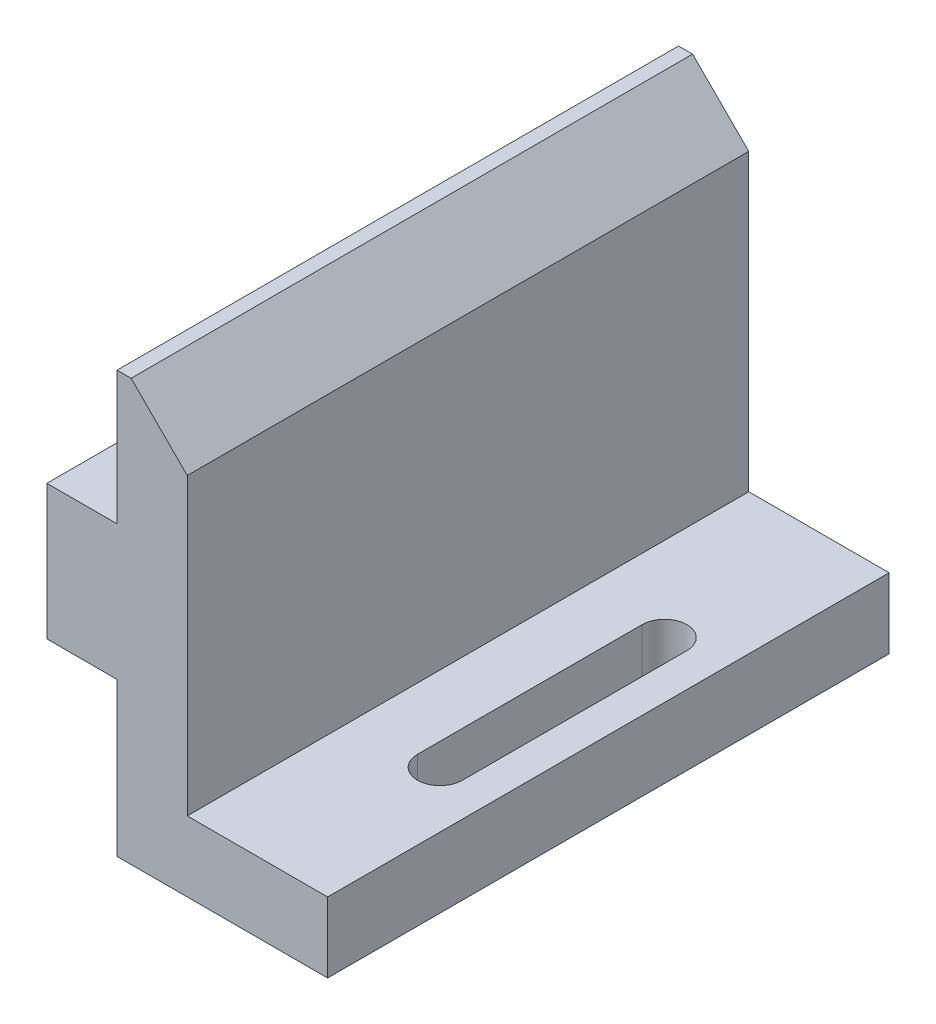
ISO-10303-21;
HEADER;
FILE_DESCRIPTION(('STEP AP214'),'2;1');
FILE_NAME('part.step','',(''),(''),'','','');
FILE_SCHEMA(('AUTOMOTIVE_DESIGN { 1 0 10303 214 1 1 1 1 }'));
ENDSEC;
DATA;
#1=APPLICATION_CONTEXT('core data for automotive mechanical design processes');
#2=APPLICATION_PROTOCOL_DEFINITION('international standard','automotive_design',2000,#1);
#3=PRODUCT_CONTEXT('',#1,'mechanical');
#4=PRODUCT('Part','Part','',(#3));
#5=PRODUCT_RELATED_PRODUCT_CATEGORY('part','',(#4));
#6=PRODUCT_DEFINITION_FORMATION('','',#4);
#7=PRODUCT_DEFINITION_CONTEXT('part definition',#1,'design');
#8=PRODUCT_DEFINITION('design','',#6,#7);
#9=PRODUCT_DEFINITION_SHAPE('','',#8);
#10=(LENGTH_UNIT() NAMED_UNIT(*) SI_UNIT(.MILLI.,.METRE.));
#11=(NAMED_UNIT(*) PLANE_ANGLE_UNIT() SI_UNIT($,.RADIAN.));
#12=(NAMED_UNIT(*) SI_UNIT($,.STERADIAN.) SOLID_ANGLE_UNIT());
#13=UNCERTAINTY_MEASURE_WITH_UNIT(LENGTH_MEASURE(1.E-05),#10,'distance_accuracy_value','');
#14=(GEOMETRIC_REPRESENTATION_CONTEXT(3) GLOBAL_UNCERTAINTY_ASSIGNED_CONTEXT((#13)) GLOBAL_UNIT_ASSIGNED_CONTEXT((#10,
#11,#12)) REPRESENTATION_CONTEXT('',''));
#15=CARTESIAN_POINT('',(0.,0.,0.));
#16=DIRECTION('',(0.,0.,1.));
#17=DIRECTION('',(1.,0.,0.));
#18=AXIS2_PLACEMENT_3D('',#15,#16,#17);
#19=CARTESIAN_POINT('',(0.,19.05,12.7));
#20=DIRECTION('',(1.,0.,0.));
#21=DIRECTION('',(0.,1.,0.));
#22=AXIS2_PLACEMENT_3D('',#19,#20,#21);
#23=PLANE('',#22);
#24=DIRECTION('',(0.,0.,-1.));
#25=VECTOR('',#24,1.);
#26=CARTESIAN_POINT('',(0.,13.0302,12.7));
#27=LINE('',#26,#25);
#28=CARTESIAN_POINT('',(0.,13.0302,12.7));
#29=VERTEX_POINT('',#28);
#30=CARTESIAN_POINT('',(0.,13.0302,-12.7));
#31=VERTEX_POINT('',#30);
#32=EDGE_CURVE('E215',#29,#31,#27,.T.);
#33=ORIENTED_EDGE('',*,*,#32,.F.);
#34=DIRECTION('',(0.,-1.,0.));
#35=VECTOR('',#34,1.);
#36=CARTESIAN_POINT('',(0.,19.05,12.7));
#37=LINE('',#36,#35);
#38=CARTESIAN_POINT('',(0.,19.05,12.7));
#39=VERTEX_POINT('',#38);
#40=EDGE_CURVE('E219',#39,#29,#37,.T.);
#41=ORIENTED_EDGE('',*,*,#40,.F.);
#42=DIRECTION('',(0.,0.,-1.));
#43=VECTOR('',#42,1.);
#44=CARTESIAN_POINT('',(0.,19.05,12.7));
#45=LINE('',#44,#43);
#46=CARTESIAN_POINT('',(0.,19.05,-12.7));
#47=VERTEX_POINT('',#46);
#48=EDGE_CURVE('E233',#39,#47,#45,.T.);
#49=ORIENTED_EDGE('',*,*,#48,.T.);
#50=DIRECTION('',(0.,-1.,0.));
#51=VECTOR('',#50,1.);
#52=CARTESIAN_POINT('',(0.,19.05,-12.7));
#53=LINE('',#52,#51);
#54=EDGE_CURVE('E234',#47,#31,#53,.T.);
#55=ORIENTED_EDGE('',*,*,#54,.T.);
#56=EDGE_LOOP('',(#33,#41,#49,#55));
#57=FACE_BOUND('',#56,.T.);
#58=ADVANCED_FACE('F43',(#57),#23,.F.);
#59=CARTESIAN_POINT('',(0.,6.9342,12.7));
#60=VERTEX_POINT('',#59);
#61=CARTESIAN_POINT('',(0.,0.,12.7));
#62=VERTEX_POINT('',#61);
#63=EDGE_CURVE('E223',#60,#62,#37,.T.);
#64=ORIENTED_EDGE('',*,*,#63,.F.);
#65=DIRECTION('',(0.,0.,-1.));
#66=VECTOR('',#65,1.);
#67=CARTESIAN_POINT('',(0.,6.9342,12.7));
#68=LINE('',#67,#66);
#69=CARTESIAN_POINT('',(0.,6.9342,-12.7));
#70=VERTEX_POINT('',#69);
#71=EDGE_CURVE('E202',#60,#70,#68,.T.);
#72=ORIENTED_EDGE('',*,*,#71,.T.);
#73=CARTESIAN_POINT('',(0.,0.,-12.7));
#74=VERTEX_POINT('',#73);
#75=EDGE_CURVE('E218',#70,#74,#53,.T.);
#76=ORIENTED_EDGE('',*,*,#75,.T.);
#77=DIRECTION('',(0.,0.,-1.));
#78=VECTOR('',#77,1.);
#79=CARTESIAN_POINT('',(0.,0.,12.7));
#80=LINE('',#79,#78);
#81=EDGE_CURVE('E258',#62,#74,#80,.T.);
#82=ORIENTED_EDGE('',*,*,#81,.F.);
#83=EDGE_LOOP('',(#64,#72,#76,#82));
#84=FACE_BOUND('',#83,.T.);
#85=ADVANCED_FACE('F288',(#84),#23,.F.);
#86=CARTESIAN_POINT('',(0.,0.,12.7));
#87=DIRECTION('',(0.,1.,0.));
#88=DIRECTION('',(0.,0.,1.));
#89=AXIS2_PLACEMENT_3D('',#86,#87,#88);
#90=PLANE('',#89);
#91=DIRECTION('',(0.,0.,-1.));
#92=VECTOR('',#91,1.);
#93=CARTESIAN_POINT('',(8.001,0.,-5.08));
#94=LINE('',#93,#92);
#95=CARTESIAN_POINT('',(8.001,0.,5.08));
#96=VERTEX_POINT('',#95);
#97=CARTESIAN_POINT('',(8.001,0.,-5.08));
#98=VERTEX_POINT('',#97);
#99=EDGE_CURVE('E163',#96,#98,#94,.T.);
#100=ORIENTED_EDGE('',*,*,#99,.T.);
#101=CARTESIAN_POINT('',(6.985,0.,-5.08));
#102=DIRECTION('',(0.,1.,0.));
#103=DIRECTION('',(-1.,0.,0.));
#104=AXIS2_PLACEMENT_3D('',#101,#102,#103);
#105=CIRCLE('',#104,1.016);
#106=CARTESIAN_POINT('',(5.969,0.,-5.08));
#107=VERTEX_POINT('',#106);
#108=EDGE_CURVE('E155',#98,#107,#105,.T.);
#109=ORIENTED_EDGE('',*,*,#108,.T.);
#110=DIRECTION('',(0.,0.,1.));
#111=VECTOR('',#110,1.);
#112=CARTESIAN_POINT('',(5.969,0.,-5.08));
#113=LINE('',#112,#111);
#114=CARTESIAN_POINT('',(5.969,0.,5.08));
#115=VERTEX_POINT('',#114);
#116=EDGE_CURVE('E167',#107,#115,#113,.T.);
#117=ORIENTED_EDGE('',*,*,#116,.T.);
#118=CARTESIAN_POINT('',(6.985,0.,5.08));
#119=DIRECTION('',(0.,1.,0.));
#120=DIRECTION('',(-1.,0.,0.));
#121=AXIS2_PLACEMENT_3D('',#118,#119,#120);
#122=CIRCLE('',#121,1.016);
#123=EDGE_CURVE('E171',#115,#96,#122,.T.);
#124=ORIENTED_EDGE('',*,*,#123,.T.);
#125=EDGE_LOOP('',(#100,#109,#117,#124));
#126=FACE_BOUND('',#125,.T.);
#127=DIRECTION('',(1.,0.,0.));
#128=VECTOR('',#127,1.);
#129=CARTESIAN_POINT('',(0.,0.,-12.7));
#130=LINE('',#129,#128);
#131=CARTESIAN_POINT('',(9.525,0.,-12.7));
#132=VERTEX_POINT('',#131);
#133=EDGE_CURVE('E237',#74,#132,#130,.T.);
#134=ORIENTED_EDGE('',*,*,#133,.T.);
#135=DIRECTION('',(0.,0.,-1.));
#136=VECTOR('',#135,1.);
#137=CARTESIAN_POINT('',(9.525,0.,12.7));
#138=LINE('',#137,#136);
#139=CARTESIAN_POINT('',(9.525,0.,12.7));
#140=VERTEX_POINT('',#139);
#141=EDGE_CURVE('E255',#140,#132,#138,.T.);
#142=ORIENTED_EDGE('',*,*,#141,.F.);
#143=DIRECTION('',(1.,0.,0.));
#144=VECTOR('',#143,1.);
#145=CARTESIAN_POINT('',(0.,0.,12.7));
#146=LINE('',#145,#144);
#147=EDGE_CURVE('E222',#62,#140,#146,.T.);
#148=ORIENTED_EDGE('',*,*,#147,.F.);
#149=ORIENTED_EDGE('',*,*,#81,.T.);
#150=EDGE_LOOP('',(#134,#142,#148,#149));
#151=FACE_BOUND('',#150,.T.);
#152=ADVANCED_FACE('F173',(#126,#151),#90,.F.);
#153=CARTESIAN_POINT('',(9.525,0.,12.7));
#154=DIRECTION('',(-1.,0.,0.));
#155=DIRECTION('',(0.,0.,1.));
#156=AXIS2_PLACEMENT_3D('',#153,#154,#155);
#157=PLANE('',#156);
#158=DIRECTION('',(0.,1.,0.));
#159=VECTOR('',#158,1.);
#160=CARTESIAN_POINT('',(9.525,0.,-12.7));
#161=LINE('',#160,#159);
#162=CARTESIAN_POINT('',(9.525,3.175,-12.7));
#163=VERTEX_POINT('',#162);
#164=EDGE_CURVE('E239',#132,#163,#161,.T.);
#165=ORIENTED_EDGE('',*,*,#164,.T.);
#166=DIRECTION('',(0.,0.,-1.));
#167=VECTOR('',#166,1.);
#168=CARTESIAN_POINT('',(9.525,3.175,12.7));
#169=LINE('',#168,#167);
#170=CARTESIAN_POINT('',(9.525,3.175,12.7));
#171=VERTEX_POINT('',#170);
#172=EDGE_CURVE('E252',#171,#163,#169,.T.);
#173=ORIENTED_EDGE('',*,*,#172,.F.);
#174=DIRECTION('',(0.,1.,0.));
#175=VECTOR('',#174,1.);
#176=CARTESIAN_POINT('',(9.525,0.,12.7));
#177=LINE('',#176,#175);
#178=EDGE_CURVE('E225',#140,#171,#177,.T.);
#179=ORIENTED_EDGE('',*,*,#178,.F.);
#180=ORIENTED_EDGE('',*,*,#141,.T.);
#181=EDGE_LOOP('',(#165,#173,#179,#180));
#182=FACE_BOUND('',#181,.T.);
#183=ADVANCED_FACE('F297',(#182),#157,.F.);
#184=CARTESIAN_POINT('',(9.525,3.175,12.7));
#185=DIRECTION('',(0.,-1.,0.));
#186=DIRECTION('',(1.,0.,0.));
#187=AXIS2_PLACEMENT_3D('',#184,#185,#186);
#188=PLANE('',#187);
#189=DIRECTION('',(0.,0.,1.));
#190=VECTOR('',#189,1.);
#191=CARTESIAN_POINT('',(5.969,3.175,-5.08));
#192=LINE('',#191,#190);
#193=CARTESIAN_POINT('',(5.969,3.175,-5.08));
#194=VERTEX_POINT('',#193);
#195=CARTESIAN_POINT('',(5.969,3.175,5.08));
#196=VERTEX_POINT('',#195);
#197=EDGE_CURVE('E185',#194,#196,#192,.T.);
#198=ORIENTED_EDGE('',*,*,#197,.F.);
#199=CARTESIAN_POINT('',(6.985,3.175,-5.08));
#200=DIRECTION('',(0.,1.,0.));
#201=DIRECTION('',(-1.,0.,0.));
#202=AXIS2_PLACEMENT_3D('',#199,#200,#201);
#203=CIRCLE('',#202,1.016);
#204=CARTESIAN_POINT('',(8.001,3.175,-5.08));
#205=VERTEX_POINT('',#204);
#206=EDGE_CURVE('E158',#205,#194,#203,.T.);
#207=ORIENTED_EDGE('',*,*,#206,.F.);
#208=DIRECTION('',(0.,0.,-1.));
#209=VECTOR('',#208,1.);
#210=CARTESIAN_POINT('',(8.001,3.175,-5.08));
#211=LINE('',#210,#209);
#212=CARTESIAN_POINT('',(8.001,3.175,5.08));
#213=VERTEX_POINT('',#212);
#214=EDGE_CURVE('E176',#213,#205,#211,.T.);
#215=ORIENTED_EDGE('',*,*,#214,.F.);
#216=CARTESIAN_POINT('',(6.985,3.175,5.08));
#217=DIRECTION('',(0.,1.,0.));
#218=DIRECTION('',(-1.,0.,0.));
#219=AXIS2_PLACEMENT_3D('',#216,#217,#218);
#220=CIRCLE('',#219,1.016);
#221=EDGE_CURVE('E179',#196,#213,#220,.T.);
#222=ORIENTED_EDGE('',*,*,#221,.F.);
#223=EDGE_LOOP('',(#198,#207,#215,#222));
#224=FACE_BOUND('',#223,.T.);
#225=DIRECTION('',(-1.,0.,0.));
#226=VECTOR('',#225,1.);
#227=CARTESIAN_POINT('',(9.525,3.175,-12.7));
#228=LINE('',#227,#226);
#229=CARTESIAN_POINT('',(3.175,3.175,-12.7));
#230=VERTEX_POINT('',#229);
#231=EDGE_CURVE('E241',#163,#230,#228,.T.);
#232=ORIENTED_EDGE('',*,*,#231,.T.);
#233=DIRECTION('',(0.,0.,-1.));
#234=VECTOR('',#233,1.);
#235=CARTESIAN_POINT('',(3.175,3.175,12.7));
#236=LINE('',#235,#234);
#237=CARTESIAN_POINT('',(3.175,3.175,12.7));
#238=VERTEX_POINT('',#237);
#239=EDGE_CURVE('E249',#238,#230,#236,.T.);
#240=ORIENTED_EDGE('',*,*,#239,.F.);
#241=DIRECTION('',(-1.,0.,0.));
#242=VECTOR('',#241,1.);
#243=CARTESIAN_POINT('',(9.525,3.175,12.7));
#244=LINE('',#243,#242);
#245=EDGE_CURVE('E227',#171,#238,#244,.T.);
#246=ORIENTED_EDGE('',*,*,#245,.F.);
#247=ORIENTED_EDGE('',*,*,#172,.T.);
#248=EDGE_LOOP('',(#232,#240,#246,#247));
#249=FACE_BOUND('',#248,.T.);
#250=ADVANCED_FACE('F299',(#224,#249),#188,.F.);
#251=CARTESIAN_POINT('',(3.175,3.175,12.7));
#252=DIRECTION('',(-1.,0.,0.));
#253=DIRECTION('',(0.,0.,1.));
#254=AXIS2_PLACEMENT_3D('',#251,#252,#253);
#255=PLANE('',#254);
#256=DIRECTION('',(0.,1.,0.));
#257=VECTOR('',#256,1.);
#258=CARTESIAN_POINT('',(3.175,3.175,-12.7));
#259=LINE('',#258,#257);
#260=CARTESIAN_POINT('',(3.175,16.51,-12.7));
#261=VERTEX_POINT('',#260);
#262=EDGE_CURVE('E243',#230,#261,#259,.T.);
#263=ORIENTED_EDGE('',*,*,#262,.T.);
#264=DIRECTION('',(0.,0.,1.));
#265=VECTOR('',#264,1.);
#266=CARTESIAN_POINT('',(3.175,16.51,12.7));
#267=LINE('',#266,#265);
#268=CARTESIAN_POINT('',(3.175,16.51,12.7));
#269=VERTEX_POINT('',#268);
#270=EDGE_CURVE('E52',#261,#269,#267,.T.);
#271=ORIENTED_EDGE('',*,*,#270,.T.);
#272=DIRECTION('',(0.,1.,0.));
#273=VECTOR('',#272,1.);
#274=CARTESIAN_POINT('',(3.175,3.175,12.7));
#275=LINE('',#274,#273);
#276=EDGE_CURVE('E229',#238,#269,#275,.T.);
#277=ORIENTED_EDGE('',*,*,#276,.F.);
#278=ORIENTED_EDGE('',*,*,#239,.T.);
#279=EDGE_LOOP('',(#263,#271,#277,#278));
#280=FACE_BOUND('',#279,.T.);
#281=ADVANCED_FACE('F303',(#280),#255,.F.);
#282=CARTESIAN_POINT('',(3.175,19.05,12.7));
#283=DIRECTION('',(0.,-1.,0.));
#284=DIRECTION('',(0.,0.,-1.));
#285=AXIS2_PLACEMENT_3D('',#282,#283,#284);
#286=PLANE('',#285);
#287=DIRECTION('',(-1.,0.,0.));
#288=VECTOR('',#287,1.);
#289=CARTESIAN_POINT('',(3.175,19.05,12.7));
#290=LINE('',#289,#288);
#291=CARTESIAN_POINT('',(0.635000000000004,19.05,12.7));
#292=VERTEX_POINT('',#291);
#293=EDGE_CURVE('E231',#292,#39,#290,.T.);
#294=ORIENTED_EDGE('',*,*,#293,.F.);
#295=DIRECTION('',(0.,0.,-1.));
#296=VECTOR('',#295,1.);
#297=CARTESIAN_POINT('',(0.635000000000004,19.05,12.7));
#298=LINE('',#297,#296);
#299=CARTESIAN_POINT('',(0.635000000000004,19.05,-12.7));
#300=VERTEX_POINT('',#299);
#301=EDGE_CURVE('E261',#292,#300,#298,.T.);
#302=ORIENTED_EDGE('',*,*,#301,.T.);
#303=DIRECTION('',(-1.,0.,0.));
#304=VECTOR('',#303,1.);
#305=CARTESIAN_POINT('',(3.175,19.05,-12.7));
#306=LINE('',#305,#304);
#307=EDGE_CURVE('E245',#300,#47,#306,.T.);
#308=ORIENTED_EDGE('',*,*,#307,.T.);
#309=ORIENTED_EDGE('',*,*,#48,.F.);
#310=EDGE_LOOP('',(#294,#302,#308,#309));
#311=FACE_BOUND('',#310,.T.);
#312=ADVANCED_FACE('F267',(#311),#286,.F.);
#313=CARTESIAN_POINT('',(0.,0.,12.7));
#314=DIRECTION('',(0.,0.,1.));
#315=DIRECTION('',(1.,0.,0.));
#316=AXIS2_PLACEMENT_3D('',#313,#314,#315);
#317=PLANE('',#316);
#318=ORIENTED_EDGE('',*,*,#276,.T.);
#319=DIRECTION('',(0.707106781186547,-0.707106781186548,0.));
#320=VECTOR('',#319,1.);
#321=CARTESIAN_POINT('',(9.8425,9.84249999999998,12.7));
#322=LINE('',#321,#320);
#323=EDGE_CURVE('E11',#269,#292,#322,.F.);
#324=ORIENTED_EDGE('',*,*,#323,.T.);
#325=ORIENTED_EDGE('',*,*,#293,.T.);
#326=ORIENTED_EDGE('',*,*,#40,.T.);
#327=DIRECTION('',(-1.,0.,0.));
#328=VECTOR('',#327,1.);
#329=CARTESIAN_POINT('',(0.,13.0302,12.7));
#330=LINE('',#329,#328);
#331=CARTESIAN_POINT('',(-3.175,13.0302,12.7));
#332=VERTEX_POINT('',#331);
#333=EDGE_CURVE('E195',#29,#332,#330,.T.);
#334=ORIENTED_EDGE('',*,*,#333,.T.);
#335=DIRECTION('',(0.,-1.,0.));
#336=VECTOR('',#335,1.);
#337=CARTESIAN_POINT('',(-3.175,13.0302,12.7));
#338=LINE('',#337,#336);
#339=CARTESIAN_POINT('',(-3.175,6.9342,12.7));
#340=VERTEX_POINT('',#339);
#341=EDGE_CURVE('E197',#332,#340,#338,.T.);
#342=ORIENTED_EDGE('',*,*,#341,.T.);
#343=DIRECTION('',(1.,0.,0.));
#344=VECTOR('',#343,1.);
#345=CARTESIAN_POINT('',(0.,6.9342,12.7));
#346=LINE('',#345,#344);
#347=EDGE_CURVE('E200',#340,#60,#346,.T.);
#348=ORIENTED_EDGE('',*,*,#347,.T.);
#349=ORIENTED_EDGE('',*,*,#63,.T.);
#350=ORIENTED_EDGE('',*,*,#147,.T.);
#351=ORIENTED_EDGE('',*,*,#178,.T.);
#352=ORIENTED_EDGE('',*,*,#245,.T.);
#353=EDGE_LOOP('',(#318,#324,#325,#326,#334,#342,#348,#349,#350,#351,#352));
#354=FACE_BOUND('',#353,.T.);
#355=ADVANCED_FACE('F278',(#354),#317,.T.);
#356=CARTESIAN_POINT('',(0.,0.,-12.7));
#357=DIRECTION('',(0.,0.,1.));
#358=DIRECTION('',(1.,0.,0.));
#359=AXIS2_PLACEMENT_3D('',#356,#357,#358);
#360=PLANE('',#359);
#361=ORIENTED_EDGE('',*,*,#307,.F.);
#362=DIRECTION('',(-0.707106781186547,0.707106781186548,0.));
#363=VECTOR('',#362,1.);
#364=CARTESIAN_POINT('',(0.635000000000004,19.05,-12.7));
#365=LINE('',#364,#363);
#366=EDGE_CURVE('E66',#300,#261,#365,.F.);
#367=ORIENTED_EDGE('',*,*,#366,.T.);
#368=ORIENTED_EDGE('',*,*,#262,.F.);
#369=ORIENTED_EDGE('',*,*,#231,.F.);
#370=ORIENTED_EDGE('',*,*,#164,.F.);
#371=ORIENTED_EDGE('',*,*,#133,.F.);
#372=ORIENTED_EDGE('',*,*,#75,.F.);
#373=DIRECTION('',(1.,0.,0.));
#374=VECTOR('',#373,1.);
#375=CARTESIAN_POINT('',(0.,6.9342,-12.7));
#376=LINE('',#375,#374);
#377=CARTESIAN_POINT('',(-3.175,6.9342,-12.7));
#378=VERTEX_POINT('',#377);
#379=EDGE_CURVE('E198',#378,#70,#376,.T.);
#380=ORIENTED_EDGE('',*,*,#379,.F.);
#381=DIRECTION('',(0.,-1.,0.));
#382=VECTOR('',#381,1.);
#383=CARTESIAN_POINT('',(-3.175,13.0302,-12.7));
#384=LINE('',#383,#382);
#385=CARTESIAN_POINT('',(-3.175,13.0302,-12.7));
#386=VERTEX_POINT('',#385);
#387=EDGE_CURVE('E204',#386,#378,#384,.T.);
#388=ORIENTED_EDGE('',*,*,#387,.F.);
#389=DIRECTION('',(-1.,0.,0.));
#390=VECTOR('',#389,1.);
#391=CARTESIAN_POINT('',(0.,13.0302,-12.7));
#392=LINE('',#391,#390);
#393=EDGE_CURVE('E191',#31,#386,#392,.T.);
#394=ORIENTED_EDGE('',*,*,#393,.F.);
#395=ORIENTED_EDGE('',*,*,#54,.F.);
#396=EDGE_LOOP('',(#361,#367,#368,#369,#370,#371,#372,#380,#388,#394,#395));
#397=FACE_BOUND('',#396,.T.);
#398=ADVANCED_FACE('F272',(#397),#360,.F.);
#399=CARTESIAN_POINT('',(0.,13.0302,12.7));
#400=DIRECTION('',(0.,-1.,0.));
#401=DIRECTION('',(1.,0.,0.));
#402=AXIS2_PLACEMENT_3D('',#399,#400,#401);
#403=PLANE('',#402);
#404=ORIENTED_EDGE('',*,*,#393,.T.);
#405=DIRECTION('',(0.,0.,-1.));
#406=VECTOR('',#405,1.);
#407=CARTESIAN_POINT('',(-3.175,13.0302,12.7));
#408=LINE('',#407,#406);
#409=EDGE_CURVE('E212',#332,#386,#408,.T.);
#410=ORIENTED_EDGE('',*,*,#409,.F.);
#411=ORIENTED_EDGE('',*,*,#333,.F.);
#412=ORIENTED_EDGE('',*,*,#32,.T.);
#413=EDGE_LOOP('',(#404,#410,#411,#412));
#414=FACE_BOUND('',#413,.T.);
#415=ADVANCED_FACE('F310',(#414),#403,.F.);
#416=CARTESIAN_POINT('',(-3.175,13.0302,12.7));
#417=DIRECTION('',(1.,0.,0.));
#418=DIRECTION('',(0.,0.,-1.));
#419=AXIS2_PLACEMENT_3D('',#416,#417,#418);
#420=PLANE('',#419);
#421=ORIENTED_EDGE('',*,*,#387,.T.);
#422=DIRECTION('',(0.,0.,-1.));
#423=VECTOR('',#422,1.);
#424=CARTESIAN_POINT('',(-3.175,6.9342,12.7));
#425=LINE('',#424,#423);
#426=EDGE_CURVE('E209',#340,#378,#425,.T.);
#427=ORIENTED_EDGE('',*,*,#426,.F.);
#428=ORIENTED_EDGE('',*,*,#341,.F.);
#429=ORIENTED_EDGE('',*,*,#409,.T.);
#430=EDGE_LOOP('',(#421,#427,#428,#429));
#431=FACE_BOUND('',#430,.T.);
#432=ADVANCED_FACE('F315',(#431),#420,.F.);
#433=CARTESIAN_POINT('',(0.,6.9342,12.7));
#434=DIRECTION('',(0.,1.,0.));
#435=DIRECTION('',(0.,0.,1.));
#436=AXIS2_PLACEMENT_3D('',#433,#434,#435);
#437=PLANE('',#436);
#438=ORIENTED_EDGE('',*,*,#379,.T.);
#439=ORIENTED_EDGE('',*,*,#71,.F.);
#440=ORIENTED_EDGE('',*,*,#347,.F.);
#441=ORIENTED_EDGE('',*,*,#426,.T.);
#442=EDGE_LOOP('',(#438,#439,#440,#441));
#443=FACE_BOUND('',#442,.T.);
#444=ADVANCED_FACE('F319',(#443),#437,.F.);
#445=CARTESIAN_POINT('',(6.985,0.,-5.08));
#446=DIRECTION('',(0.,1.,0.));
#447=DIRECTION('',(-1.,0.,0.));
#448=AXIS2_PLACEMENT_3D('',#445,#446,#447);
#449=CYLINDRICAL_SURFACE('',#448,1.016);
#450=ORIENTED_EDGE('',*,*,#206,.T.);
#451=DIRECTION('',(0.,1.,0.));
#452=VECTOR('',#451,1.);
#453=CARTESIAN_POINT('',(5.969,0.,-5.08));
#454=LINE('',#453,#452);
#455=EDGE_CURVE('E151',#107,#194,#454,.T.);
#456=ORIENTED_EDGE('',*,*,#455,.F.);
#457=ORIENTED_EDGE('',*,*,#108,.F.);
#458=DIRECTION('',(0.,1.,0.));
#459=VECTOR('',#458,1.);
#460=CARTESIAN_POINT('',(8.001,0.,-5.08));
#461=LINE('',#460,#459);
#462=EDGE_CURVE('E189',#98,#205,#461,.T.);
#463=ORIENTED_EDGE('',*,*,#462,.T.);
#464=EDGE_LOOP('',(#450,#456,#457,#463));
#465=FACE_BOUND('',#464,.T.);
#466=ADVANCED_FACE('F153',(#465),#449,.F.);
#467=CARTESIAN_POINT('',(8.001,0.,-5.08));
#468=DIRECTION('',(1.,0.,0.));
#469=DIRECTION('',(0.,1.,0.));
#470=AXIS2_PLACEMENT_3D('',#467,#468,#469);
#471=PLANE('',#470);
#472=ORIENTED_EDGE('',*,*,#214,.T.);
#473=ORIENTED_EDGE('',*,*,#462,.F.);
#474=ORIENTED_EDGE('',*,*,#99,.F.);
#475=DIRECTION('',(0.,1.,0.));
#476=VECTOR('',#475,1.);
#477=CARTESIAN_POINT('',(8.001,0.,5.08));
#478=LINE('',#477,#476);
#479=EDGE_CURVE('E192',#96,#213,#478,.T.);
#480=ORIENTED_EDGE('',*,*,#479,.T.);
#481=EDGE_LOOP('',(#472,#473,#474,#480));
#482=FACE_BOUND('',#481,.T.);
#483=ADVANCED_FACE('F325',(#482),#471,.F.);
#484=CARTESIAN_POINT('',(6.985,0.,5.08));
#485=DIRECTION('',(0.,1.,0.));
#486=DIRECTION('',(-1.,0.,0.));
#487=AXIS2_PLACEMENT_3D('',#484,#485,#486);
#488=CYLINDRICAL_SURFACE('',#487,1.016);
#489=ORIENTED_EDGE('',*,*,#221,.T.);
#490=ORIENTED_EDGE('',*,*,#479,.F.);
#491=ORIENTED_EDGE('',*,*,#123,.F.);
#492=DIRECTION('',(0.,1.,0.));
#493=VECTOR('',#492,1.);
#494=CARTESIAN_POINT('',(5.969,0.,5.08));
#495=LINE('',#494,#493);
#496=EDGE_CURVE('E162',#115,#196,#495,.T.);
#497=ORIENTED_EDGE('',*,*,#496,.T.);
#498=EDGE_LOOP('',(#489,#490,#491,#497));
#499=FACE_BOUND('',#498,.T.);
#500=ADVANCED_FACE('F285',(#499),#488,.F.);
#501=CARTESIAN_POINT('',(5.969,0.,-5.08));
#502=DIRECTION('',(-1.,0.,0.));
#503=DIRECTION('',(0.,-1.,0.));
#504=AXIS2_PLACEMENT_3D('',#501,#502,#503);
#505=PLANE('',#504);
#506=ORIENTED_EDGE('',*,*,#197,.T.);
#507=ORIENTED_EDGE('',*,*,#496,.F.);
#508=ORIENTED_EDGE('',*,*,#116,.F.);
#509=ORIENTED_EDGE('',*,*,#455,.T.);
#510=EDGE_LOOP('',(#506,#507,#508,#509));
#511=FACE_BOUND('',#510,.T.);
#512=ADVANCED_FACE('F168',(#511),#505,.F.);
#513=CARTESIAN_POINT('',(0.635000000000004,19.05,12.7));
#514=DIRECTION('',(-0.707106781186548,-0.707106781186547,0.));
#515=DIRECTION('',(0.,0.,-1.));
#516=AXIS2_PLACEMENT_3D('',#513,#514,#515);
#517=PLANE('',#516);
#518=ORIENTED_EDGE('',*,*,#323,.F.);
#519=ORIENTED_EDGE('',*,*,#270,.F.);
#520=ORIENTED_EDGE('',*,*,#366,.F.);
#521=ORIENTED_EDGE('',*,*,#301,.F.);
#522=EDGE_LOOP('',(#518,#519,#520,#521));
#523=FACE_BOUND('',#522,.T.);
#524=ADVANCED_FACE('F46',(#523),#517,.F.);
#525=CLOSED_SHELL('',(#58,#85,#152,#183,#250,#281,#312,#355,#398,#415,#432,#444,#466,#483,#500,
#512,#524));
#526=MANIFOLD_SOLID_BREP('B2',#525);
#527=ADVANCED_BREP_SHAPE_REPRESENTATION('',(#18,#526),#14);
#528=SHAPE_DEFINITION_REPRESENTATION(#9,#527);
ENDSEC;
END-ISO-10303-21;
